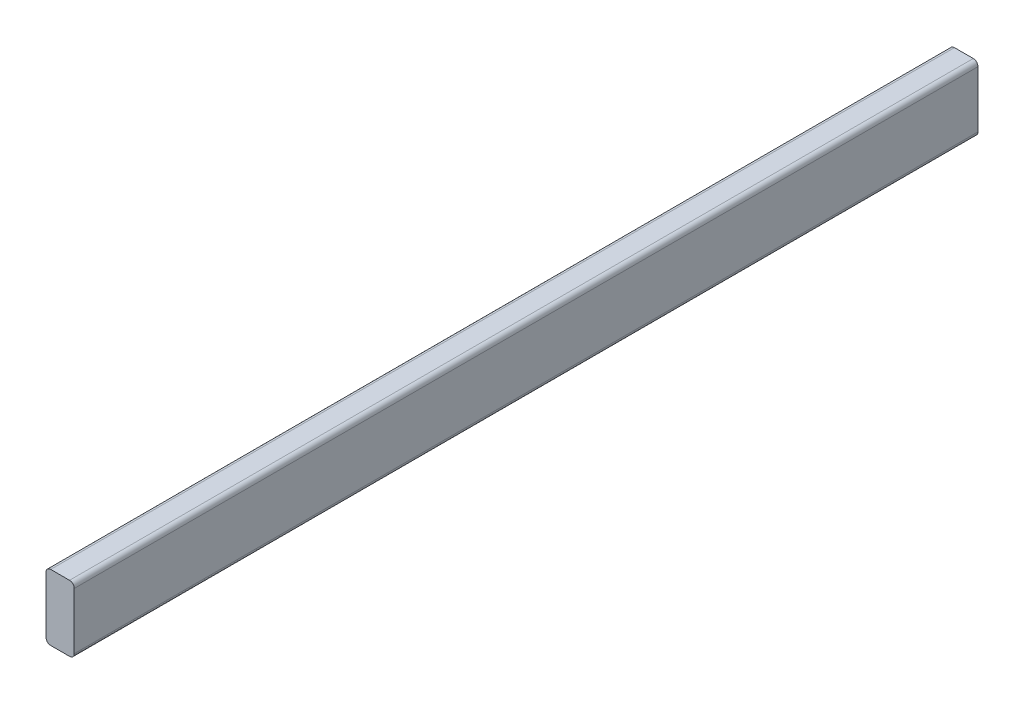
ISO-10303-21;
HEADER;
FILE_DESCRIPTION(('STEP AP214'),'2;1');
FILE_NAME('part.step','',(''),(''),'','','');
FILE_SCHEMA(('AUTOMOTIVE_DESIGN { 1 0 10303 214 1 1 1 1 }'));
ENDSEC;
DATA;
#1=APPLICATION_CONTEXT('core data for automotive mechanical design processes');
#2=APPLICATION_PROTOCOL_DEFINITION('international standard','automotive_design',2000,#1);
#3=PRODUCT_CONTEXT('',#1,'mechanical');
#4=PRODUCT('Part','Part','',(#3));
#5=PRODUCT_RELATED_PRODUCT_CATEGORY('part','',(#4));
#6=PRODUCT_DEFINITION_FORMATION('','',#4);
#7=PRODUCT_DEFINITION_CONTEXT('part definition',#1,'design');
#8=PRODUCT_DEFINITION('design','',#6,#7);
#9=PRODUCT_DEFINITION_SHAPE('','',#8);
#10=(LENGTH_UNIT() NAMED_UNIT(*) SI_UNIT(.MILLI.,.METRE.));
#11=(NAMED_UNIT(*) PLANE_ANGLE_UNIT() SI_UNIT($,.RADIAN.));
#12=(NAMED_UNIT(*) SI_UNIT($,.STERADIAN.) SOLID_ANGLE_UNIT());
#13=UNCERTAINTY_MEASURE_WITH_UNIT(LENGTH_MEASURE(1.E-05),#10,'distance_accuracy_value','');
#14=(GEOMETRIC_REPRESENTATION_CONTEXT(3) GLOBAL_UNCERTAINTY_ASSIGNED_CONTEXT((#13)) GLOBAL_UNIT_ASSIGNED_CONTEXT((#10,
#11,#12)) REPRESENTATION_CONTEXT('',''));
#15=CARTESIAN_POINT('',(0.,0.,0.));
#16=DIRECTION('',(0.,0.,1.));
#17=DIRECTION('',(1.,0.,0.));
#18=AXIS2_PLACEMENT_3D('',#15,#16,#17);
#19=CARTESIAN_POINT('',(-12.7,-38.1,1219.2));
#20=DIRECTION('',(0.,0.,-1.));
#21=DIRECTION('',(-1.,0.,0.));
#22=AXIS2_PLACEMENT_3D('',#19,#20,#21);
#23=CYLINDRICAL_SURFACE('',#22,6.35);
#24=CARTESIAN_POINT('',(-12.7,-38.1,0.));
#25=DIRECTION('',(0.,0.,1.));
#26=DIRECTION('',(1.,0.,0.));
#27=AXIS2_PLACEMENT_3D('',#24,#25,#26);
#28=CIRCLE('',#27,6.35);
#29=CARTESIAN_POINT('',(-19.05,-38.0999999999999,0.));
#30=VERTEX_POINT('',#29);
#31=CARTESIAN_POINT('',(-12.7,-44.45,0.));
#32=VERTEX_POINT('',#31);
#33=EDGE_CURVE('E128',#30,#32,#28,.T.);
#34=ORIENTED_EDGE('',*,*,#33,.T.);
#35=DIRECTION('',(0.,0.,-1.));
#36=VECTOR('',#35,1.);
#37=CARTESIAN_POINT('',(-12.7,-44.45,1219.2));
#38=LINE('',#37,#36);
#39=CARTESIAN_POINT('',(-12.7,-44.45,1219.2));
#40=VERTEX_POINT('',#39);
#41=EDGE_CURVE('E11',#40,#32,#38,.T.);
#42=ORIENTED_EDGE('',*,*,#41,.F.);
#43=CARTESIAN_POINT('',(-12.7,-38.1,1219.2));
#44=DIRECTION('',(0.,0.,1.));
#45=DIRECTION('',(1.,0.,0.));
#46=AXIS2_PLACEMENT_3D('',#43,#44,#45);
#47=CIRCLE('',#46,6.35);
#48=CARTESIAN_POINT('',(-19.05,-38.0999999999999,1219.2));
#49=VERTEX_POINT('',#48);
#50=EDGE_CURVE('E142',#49,#40,#47,.T.);
#51=ORIENTED_EDGE('',*,*,#50,.F.);
#52=DIRECTION('',(0.,0.,-1.));
#53=VECTOR('',#52,1.);
#54=CARTESIAN_POINT('',(-19.05,-38.0999999999999,1219.2));
#55=LINE('',#54,#53);
#56=EDGE_CURVE('E124',#49,#30,#55,.T.);
#57=ORIENTED_EDGE('',*,*,#56,.T.);
#58=EDGE_LOOP('',(#34,#42,#51,#57));
#59=FACE_BOUND('',#58,.T.);
#60=ADVANCED_FACE('F32',(#59),#23,.T.);
#61=CARTESIAN_POINT('',(-12.7,-44.45,1219.2));
#62=DIRECTION('',(0.,1.,0.));
#63=DIRECTION('',(0.,0.,1.));
#64=AXIS2_PLACEMENT_3D('',#61,#62,#63);
#65=PLANE('',#64);
#66=DIRECTION('',(1.,0.,0.));
#67=VECTOR('',#66,1.);
#68=CARTESIAN_POINT('',(-12.7,-44.45,0.));
#69=LINE('',#68,#67);
#70=CARTESIAN_POINT('',(12.6999999999999,-44.45,0.));
#71=VERTEX_POINT('',#70);
#72=EDGE_CURVE('E131',#32,#71,#69,.T.);
#73=ORIENTED_EDGE('',*,*,#72,.T.);
#74=DIRECTION('',(0.,0.,-1.));
#75=VECTOR('',#74,1.);
#76=CARTESIAN_POINT('',(12.6999999999999,-44.45,1219.2));
#77=LINE('',#76,#75);
#78=CARTESIAN_POINT('',(12.6999999999999,-44.45,1219.2));
#79=VERTEX_POINT('',#78);
#80=EDGE_CURVE('E40',#79,#71,#77,.T.);
#81=ORIENTED_EDGE('',*,*,#80,.F.);
#82=DIRECTION('',(1.,0.,0.));
#83=VECTOR('',#82,1.);
#84=CARTESIAN_POINT('',(-12.7,-44.45,1219.2));
#85=LINE('',#84,#83);
#86=EDGE_CURVE('E91',#40,#79,#85,.T.);
#87=ORIENTED_EDGE('',*,*,#86,.F.);
#88=ORIENTED_EDGE('',*,*,#41,.T.);
#89=EDGE_LOOP('',(#73,#81,#87,#88));
#90=FACE_BOUND('',#89,.T.);
#91=ADVANCED_FACE('F177',(#90),#65,.F.);
#92=CARTESIAN_POINT('',(12.7,-38.1,1219.2));
#93=DIRECTION('',(0.,0.,-1.));
#94=DIRECTION('',(-1.,0.,0.));
#95=AXIS2_PLACEMENT_3D('',#92,#93,#94);
#96=CYLINDRICAL_SURFACE('',#95,6.35);
#97=CARTESIAN_POINT('',(12.7,-38.1,0.));
#98=DIRECTION('',(0.,0.,1.));
#99=DIRECTION('',(1.,0.,0.));
#100=AXIS2_PLACEMENT_3D('',#97,#98,#99);
#101=CIRCLE('',#100,6.35);
#102=CARTESIAN_POINT('',(19.05,-38.0999999999999,0.));
#103=VERTEX_POINT('',#102);
#104=EDGE_CURVE('E133',#71,#103,#101,.T.);
#105=ORIENTED_EDGE('',*,*,#104,.T.);
#106=DIRECTION('',(0.,0.,-1.));
#107=VECTOR('',#106,1.);
#108=CARTESIAN_POINT('',(19.05,-38.0999999999999,1219.2));
#109=LINE('',#108,#107);
#110=CARTESIAN_POINT('',(19.05,-38.0999999999999,1219.2));
#111=VERTEX_POINT('',#110);
#112=EDGE_CURVE('E149',#111,#103,#109,.T.);
#113=ORIENTED_EDGE('',*,*,#112,.F.);
#114=CARTESIAN_POINT('',(12.7,-38.1,1219.2));
#115=DIRECTION('',(0.,0.,1.));
#116=DIRECTION('',(1.,0.,0.));
#117=AXIS2_PLACEMENT_3D('',#114,#115,#116);
#118=CIRCLE('',#117,6.35);
#119=EDGE_CURVE('E157',#79,#111,#118,.T.);
#120=ORIENTED_EDGE('',*,*,#119,.F.);
#121=ORIENTED_EDGE('',*,*,#80,.T.);
#122=EDGE_LOOP('',(#105,#113,#120,#121));
#123=FACE_BOUND('',#122,.T.);
#124=ADVANCED_FACE('F155',(#123),#96,.T.);
#125=CARTESIAN_POINT('',(19.05,38.1,1219.2));
#126=DIRECTION('',(-1.,0.,0.));
#127=DIRECTION('',(0.,-1.,0.));
#128=AXIS2_PLACEMENT_3D('',#125,#126,#127);
#129=PLANE('',#128);
#130=DIRECTION('',(0.,1.,0.));
#131=VECTOR('',#130,1.);
#132=CARTESIAN_POINT('',(19.05,38.1,0.));
#133=LINE('',#132,#131);
#134=CARTESIAN_POINT('',(19.05,38.1,0.));
#135=VERTEX_POINT('',#134);
#136=EDGE_CURVE('E135',#103,#135,#133,.T.);
#137=ORIENTED_EDGE('',*,*,#136,.T.);
#138=DIRECTION('',(0.,0.,-1.));
#139=VECTOR('',#138,1.);
#140=CARTESIAN_POINT('',(19.05,38.1,1219.2));
#141=LINE('',#140,#139);
#142=CARTESIAN_POINT('',(19.05,38.1,1219.2));
#143=VERTEX_POINT('',#142);
#144=EDGE_CURVE('E146',#143,#135,#141,.T.);
#145=ORIENTED_EDGE('',*,*,#144,.F.);
#146=DIRECTION('',(0.,1.,0.));
#147=VECTOR('',#146,1.);
#148=CARTESIAN_POINT('',(19.05,38.1,1219.2));
#149=LINE('',#148,#147);
#150=EDGE_CURVE('E169',#111,#143,#149,.T.);
#151=ORIENTED_EDGE('',*,*,#150,.F.);
#152=ORIENTED_EDGE('',*,*,#112,.T.);
#153=EDGE_LOOP('',(#137,#145,#151,#152));
#154=FACE_BOUND('',#153,.T.);
#155=ADVANCED_FACE('F165',(#154),#129,.F.);
#156=CARTESIAN_POINT('',(12.7,38.1,1219.2));
#157=DIRECTION('',(0.,0.,-1.));
#158=DIRECTION('',(-1.,0.,0.));
#159=AXIS2_PLACEMENT_3D('',#156,#157,#158);
#160=CYLINDRICAL_SURFACE('',#159,6.35);
#161=CARTESIAN_POINT('',(12.7,38.1,0.));
#162=DIRECTION('',(0.,0.,1.));
#163=DIRECTION('',(-1.,0.,0.));
#164=AXIS2_PLACEMENT_3D('',#161,#162,#163);
#165=CIRCLE('',#164,6.35);
#166=CARTESIAN_POINT('',(12.6999999999999,44.45,0.));
#167=VERTEX_POINT('',#166);
#168=EDGE_CURVE('E137',#135,#167,#165,.T.);
#169=ORIENTED_EDGE('',*,*,#168,.T.);
#170=DIRECTION('',(0.,0.,-1.));
#171=VECTOR('',#170,1.);
#172=CARTESIAN_POINT('',(12.6999999999999,44.45,1219.2));
#173=LINE('',#172,#171);
#174=CARTESIAN_POINT('',(12.6999999999999,44.45,1219.2));
#175=VERTEX_POINT('',#174);
#176=EDGE_CURVE('E119',#175,#167,#173,.T.);
#177=ORIENTED_EDGE('',*,*,#176,.F.);
#178=CARTESIAN_POINT('',(12.7,38.1,1219.2));
#179=DIRECTION('',(0.,0.,1.));
#180=DIRECTION('',(-1.,0.,0.));
#181=AXIS2_PLACEMENT_3D('',#178,#179,#180);
#182=CIRCLE('',#181,6.35);
#183=EDGE_CURVE('E110',#143,#175,#182,.T.);
#184=ORIENTED_EDGE('',*,*,#183,.F.);
#185=ORIENTED_EDGE('',*,*,#144,.T.);
#186=EDGE_LOOP('',(#169,#177,#184,#185));
#187=FACE_BOUND('',#186,.T.);
#188=ADVANCED_FACE('F168',(#187),#160,.T.);
#189=CARTESIAN_POINT('',(-12.7,44.45,1219.2));
#190=DIRECTION('',(0.,-1.,0.));
#191=DIRECTION('',(0.,0.,-1.));
#192=AXIS2_PLACEMENT_3D('',#189,#190,#191);
#193=PLANE('',#192);
#194=DIRECTION('',(-1.,0.,0.));
#195=VECTOR('',#194,1.);
#196=CARTESIAN_POINT('',(-12.7,44.45,0.));
#197=LINE('',#196,#195);
#198=CARTESIAN_POINT('',(-12.7,44.45,0.));
#199=VERTEX_POINT('',#198);
#200=EDGE_CURVE('E118',#167,#199,#197,.T.);
#201=ORIENTED_EDGE('',*,*,#200,.T.);
#202=DIRECTION('',(0.,0.,-1.));
#203=VECTOR('',#202,1.);
#204=CARTESIAN_POINT('',(-12.7,44.45,1219.2));
#205=LINE('',#204,#203);
#206=CARTESIAN_POINT('',(-12.7,44.45,1219.2));
#207=VERTEX_POINT('',#206);
#208=EDGE_CURVE('E115',#207,#199,#205,.T.);
#209=ORIENTED_EDGE('',*,*,#208,.F.);
#210=DIRECTION('',(-1.,0.,0.));
#211=VECTOR('',#210,1.);
#212=CARTESIAN_POINT('',(-12.7,44.45,1219.2));
#213=LINE('',#212,#211);
#214=EDGE_CURVE('E104',#175,#207,#213,.T.);
#215=ORIENTED_EDGE('',*,*,#214,.F.);
#216=ORIENTED_EDGE('',*,*,#176,.T.);
#217=EDGE_LOOP('',(#201,#209,#215,#216));
#218=FACE_BOUND('',#217,.T.);
#219=ADVANCED_FACE('F116',(#218),#193,.F.);
#220=CARTESIAN_POINT('',(-12.7,38.1,1219.2));
#221=DIRECTION('',(0.,0.,-1.));
#222=DIRECTION('',(-1.,0.,0.));
#223=AXIS2_PLACEMENT_3D('',#220,#221,#222);
#224=CYLINDRICAL_SURFACE('',#223,6.35);
#225=CARTESIAN_POINT('',(-12.7,38.1,0.));
#226=DIRECTION('',(0.,0.,1.));
#227=DIRECTION('',(1.,0.,0.));
#228=AXIS2_PLACEMENT_3D('',#225,#226,#227);
#229=CIRCLE('',#228,6.35);
#230=CARTESIAN_POINT('',(-19.05,38.1,0.));
#231=VERTEX_POINT('',#230);
#232=EDGE_CURVE('E77',#199,#231,#229,.T.);
#233=ORIENTED_EDGE('',*,*,#232,.T.);
#234=DIRECTION('',(0.,0.,-1.));
#235=VECTOR('',#234,1.);
#236=CARTESIAN_POINT('',(-19.05,38.1,1219.2));
#237=LINE('',#236,#235);
#238=CARTESIAN_POINT('',(-19.05,38.1,1219.2));
#239=VERTEX_POINT('',#238);
#240=EDGE_CURVE('E120',#239,#231,#237,.T.);
#241=ORIENTED_EDGE('',*,*,#240,.F.);
#242=CARTESIAN_POINT('',(-12.7,38.1,1219.2));
#243=DIRECTION('',(0.,0.,1.));
#244=DIRECTION('',(1.,0.,0.));
#245=AXIS2_PLACEMENT_3D('',#242,#243,#244);
#246=CIRCLE('',#245,6.35);
#247=EDGE_CURVE('E108',#207,#239,#246,.T.);
#248=ORIENTED_EDGE('',*,*,#247,.F.);
#249=ORIENTED_EDGE('',*,*,#208,.T.);
#250=EDGE_LOOP('',(#233,#241,#248,#249));
#251=FACE_BOUND('',#250,.T.);
#252=ADVANCED_FACE('F122',(#251),#224,.T.);
#253=CARTESIAN_POINT('',(-19.05,38.1,1219.2));
#254=DIRECTION('',(1.,0.,0.));
#255=DIRECTION('',(0.,1.,0.));
#256=AXIS2_PLACEMENT_3D('',#253,#254,#255);
#257=PLANE('',#256);
#258=DIRECTION('',(0.,-1.,0.));
#259=VECTOR('',#258,1.);
#260=CARTESIAN_POINT('',(-19.05,38.1,0.));
#261=LINE('',#260,#259);
#262=EDGE_CURVE('E83',#231,#30,#261,.T.);
#263=ORIENTED_EDGE('',*,*,#262,.T.);
#264=ORIENTED_EDGE('',*,*,#56,.F.);
#265=DIRECTION('',(0.,-1.,0.));
#266=VECTOR('',#265,1.);
#267=CARTESIAN_POINT('',(-19.05,38.1,1219.2));
#268=LINE('',#267,#266);
#269=EDGE_CURVE('E48',#239,#49,#268,.T.);
#270=ORIENTED_EDGE('',*,*,#269,.F.);
#271=ORIENTED_EDGE('',*,*,#240,.T.);
#272=EDGE_LOOP('',(#263,#264,#270,#271));
#273=FACE_BOUND('',#272,.T.);
#274=ADVANCED_FACE('F193',(#273),#257,.F.);
#275=CARTESIAN_POINT('',(-12.7,-38.1,1219.2));
#276=DIRECTION('',(0.,0.,1.));
#277=DIRECTION('',(1.,0.,0.));
#278=AXIS2_PLACEMENT_3D('',#275,#276,#277);
#279=PLANE('',#278);
#280=ORIENTED_EDGE('',*,*,#50,.T.);
#281=ORIENTED_EDGE('',*,*,#86,.T.);
#282=ORIENTED_EDGE('',*,*,#119,.T.);
#283=ORIENTED_EDGE('',*,*,#150,.T.);
#284=ORIENTED_EDGE('',*,*,#183,.T.);
#285=ORIENTED_EDGE('',*,*,#214,.T.);
#286=ORIENTED_EDGE('',*,*,#247,.T.);
#287=ORIENTED_EDGE('',*,*,#269,.T.);
#288=EDGE_LOOP('',(#280,#281,#282,#283,#284,#285,#286,#287));
#289=FACE_BOUND('',#288,.T.);
#290=ADVANCED_FACE('F106',(#289),#279,.T.);
#291=CARTESIAN_POINT('',(-12.7,-38.1,0.));
#292=DIRECTION('',(0.,0.,1.));
#293=DIRECTION('',(1.,0.,0.));
#294=AXIS2_PLACEMENT_3D('',#291,#292,#293);
#295=PLANE('',#294);
#296=ORIENTED_EDGE('',*,*,#33,.F.);
#297=ORIENTED_EDGE('',*,*,#262,.F.);
#298=ORIENTED_EDGE('',*,*,#232,.F.);
#299=ORIENTED_EDGE('',*,*,#200,.F.);
#300=ORIENTED_EDGE('',*,*,#168,.F.);
#301=ORIENTED_EDGE('',*,*,#136,.F.);
#302=ORIENTED_EDGE('',*,*,#104,.F.);
#303=ORIENTED_EDGE('',*,*,#72,.F.);
#304=EDGE_LOOP('',(#296,#297,#298,#299,#300,#301,#302,#303));
#305=FACE_BOUND('',#304,.T.);
#306=ADVANCED_FACE('F161',(#305),#295,.F.);
#307=CLOSED_SHELL('',(#60,#91,#124,#155,#188,#219,#252,#274,#290,#306));
#308=MANIFOLD_SOLID_BREP('B2',#307);
#309=ADVANCED_BREP_SHAPE_REPRESENTATION('',(#18,#308),#14);
#310=SHAPE_DEFINITION_REPRESENTATION(#9,#309);
ENDSEC;
END-ISO-10303-21;
